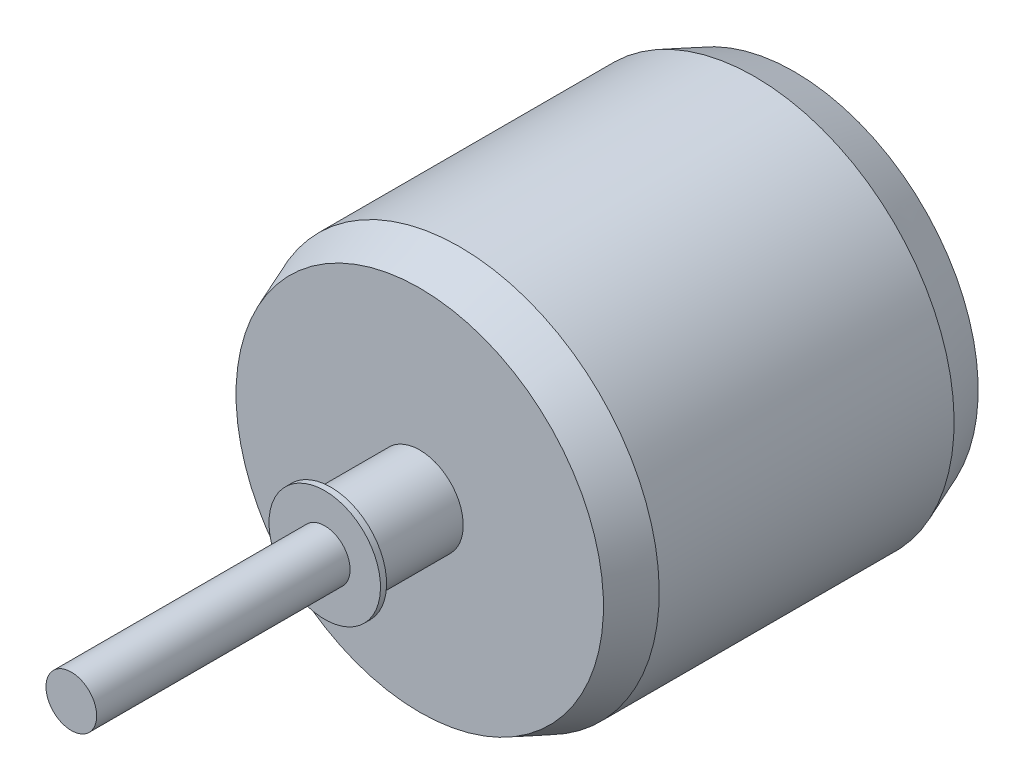
ISO-10303-21;
HEADER;
FILE_DESCRIPTION(('STEP AP214'),'2;1');
FILE_NAME('part.step','',(''),(''),'','','');
FILE_SCHEMA(('AUTOMOTIVE_DESIGN { 1 0 10303 214 1 1 1 1 }'));
ENDSEC;
DATA;
#1=APPLICATION_CONTEXT('core data for automotive mechanical design processes');
#2=APPLICATION_PROTOCOL_DEFINITION('international standard','automotive_design',2000,#1);
#3=PRODUCT_CONTEXT('',#1,'mechanical');
#4=PRODUCT('Part','Part','',(#3));
#5=PRODUCT_RELATED_PRODUCT_CATEGORY('part','',(#4));
#6=PRODUCT_DEFINITION_FORMATION('','',#4);
#7=PRODUCT_DEFINITION_CONTEXT('part definition',#1,'design');
#8=PRODUCT_DEFINITION('design','',#6,#7);
#9=PRODUCT_DEFINITION_SHAPE('','',#8);
#10=(LENGTH_UNIT() NAMED_UNIT(*) SI_UNIT(.MILLI.,.METRE.));
#11=(NAMED_UNIT(*) PLANE_ANGLE_UNIT() SI_UNIT($,.RADIAN.));
#12=(NAMED_UNIT(*) SI_UNIT($,.STERADIAN.) SOLID_ANGLE_UNIT());
#13=UNCERTAINTY_MEASURE_WITH_UNIT(LENGTH_MEASURE(1.E-05),#10,'distance_accuracy_value','');
#14=(GEOMETRIC_REPRESENTATION_CONTEXT(3) GLOBAL_UNCERTAINTY_ASSIGNED_CONTEXT((#13)) GLOBAL_UNIT_ASSIGNED_CONTEXT((#10,
#11,#12)) REPRESENTATION_CONTEXT('',''));
#15=CARTESIAN_POINT('',(0.,0.,0.));
#16=DIRECTION('',(0.,0.,1.));
#17=DIRECTION('',(1.,0.,0.));
#18=AXIS2_PLACEMENT_3D('',#15,#16,#17);
#19=CARTESIAN_POINT('',(0.,0.,-93.1144563688648));
#20=DIRECTION('',(0.,0.,-1.));
#21=DIRECTION('',(0.,1.,0.));
#22=AXIS2_PLACEMENT_3D('',#19,#20,#21);
#23=CYLINDRICAL_SURFACE('',#22,4.);
#24=CARTESIAN_POINT('',(0.,0.,58.65));
#25=DIRECTION('',(0.,0.,-1.));
#26=DIRECTION('',(0.,1.,0.));
#27=AXIS2_PLACEMENT_3D('',#24,#25,#26);
#28=CIRCLE('',#27,4.);
#29=CARTESIAN_POINT('',(0.,3.99999999999999,58.65));
#30=VERTEX_POINT('',#29);
#31=EDGE_CURVE('E10',#30,#30,#28,.T.);
#32=ORIENTED_EDGE('',*,*,#31,.T.);
#33=EDGE_LOOP('',(#32));
#34=FACE_BOUND('',#33,.T.);
#35=CARTESIAN_POINT('',(0.,0.,18.65));
#36=DIRECTION('',(0.,0.,-1.));
#37=DIRECTION('',(0.,1.,0.));
#38=AXIS2_PLACEMENT_3D('',#35,#36,#37);
#39=CIRCLE('',#38,3.99999999999999);
#40=CARTESIAN_POINT('',(0.,3.99999999999999,18.65));
#41=VERTEX_POINT('',#40);
#42=EDGE_CURVE('E94',#41,#41,#39,.T.);
#43=ORIENTED_EDGE('',*,*,#42,.F.);
#44=EDGE_LOOP('',(#43));
#45=FACE_BOUND('',#44,.T.);
#46=ADVANCED_FACE('F43',(#34,#45),#23,.T.);
#47=CARTESIAN_POINT('',(0.,0.,58.65));
#48=DIRECTION('',(0.,0.,1.));
#49=DIRECTION('',(0.,-1.,0.));
#50=AXIS2_PLACEMENT_3D('',#47,#48,#49);
#51=PLANE('',#50);
#52=ORIENTED_EDGE('',*,*,#31,.F.);
#53=EDGE_LOOP('',(#52));
#54=FACE_BOUND('',#53,.T.);
#55=ADVANCED_FACE('F103',(#54),#51,.T.);
#56=CARTESIAN_POINT('',(0.,7.,-58.65));
#57=DIRECTION('',(0.,0.,-1.));
#58=DIRECTION('',(0.,1.,0.));
#59=AXIS2_PLACEMENT_3D('',#56,#57,#58);
#60=PLANE('',#59);
#61=CARTESIAN_POINT('',(0.,0.,-58.65));
#62=DIRECTION('',(0.,0.,-1.));
#63=DIRECTION('',(0.,1.,0.));
#64=AXIS2_PLACEMENT_3D('',#61,#62,#63);
#65=CIRCLE('',#64,6.99999999999999);
#66=CARTESIAN_POINT('',(0.,7.,-58.65));
#67=VERTEX_POINT('',#66);
#68=EDGE_CURVE('E50',#67,#67,#65,.T.);
#69=ORIENTED_EDGE('',*,*,#68,.T.);
#70=EDGE_LOOP('',(#69));
#71=FACE_BOUND('',#70,.T.);
#72=ADVANCED_FACE('F107',(#71),#60,.T.);
#73=CARTESIAN_POINT('',(0.,0.,-93.1144563688648));
#74=DIRECTION('',(0.,0.,-1.));
#75=DIRECTION('',(0.,1.,0.));
#76=AXIS2_PLACEMENT_3D('',#73,#74,#75);
#77=CYLINDRICAL_SURFACE('',#76,6.99999999999999);
#78=CARTESIAN_POINT('',(0.,0.,-55.5));
#79=DIRECTION('',(0.,0.,-1.));
#80=DIRECTION('',(0.,1.,0.));
#81=AXIS2_PLACEMENT_3D('',#78,#79,#80);
#82=CIRCLE('',#81,6.99999999999999);
#83=CARTESIAN_POINT('',(0.,7.,-55.5));
#84=VERTEX_POINT('',#83);
#85=EDGE_CURVE('E55',#84,#84,#82,.T.);
#86=ORIENTED_EDGE('',*,*,#85,.T.);
#87=EDGE_LOOP('',(#86));
#88=FACE_BOUND('',#87,.T.);
#89=ORIENTED_EDGE('',*,*,#68,.F.);
#90=EDGE_LOOP('',(#89));
#91=FACE_BOUND('',#90,.T.);
#92=ADVANCED_FACE('F112',(#88,#91),#77,.T.);
#93=CARTESIAN_POINT('',(0.,7.,-55.5));
#94=DIRECTION('',(0.,0.,-1.));
#95=DIRECTION('',(0.,1.,0.));
#96=AXIS2_PLACEMENT_3D('',#93,#94,#95);
#97=PLANE('',#96);
#98=CARTESIAN_POINT('',(0.,0.,-55.5));
#99=DIRECTION('',(0.,0.,-1.));
#100=DIRECTION('',(0.,1.,0.));
#101=AXIS2_PLACEMENT_3D('',#98,#99,#100);
#102=CIRCLE('',#101,29.);
#103=CARTESIAN_POINT('',(0.,29.,-55.5));
#104=VERTEX_POINT('',#103);
#105=EDGE_CURVE('E60',#104,#104,#102,.T.);
#106=ORIENTED_EDGE('',*,*,#105,.T.);
#107=EDGE_LOOP('',(#106));
#108=FACE_BOUND('',#107,.T.);
#109=ORIENTED_EDGE('',*,*,#85,.F.);
#110=EDGE_LOOP('',(#109));
#111=FACE_BOUND('',#110,.T.);
#112=ADVANCED_FACE('F117',(#108,#111),#97,.T.);
#113=CARTESIAN_POINT('',(0.,0.,-55.5));
#114=DIRECTION('',(0.,0.,1.));
#115=DIRECTION('',(0.,-1.,0.));
#116=AXIS2_PLACEMENT_3D('',#113,#114,#115);
#117=CONICAL_SURFACE('',#116,29.,0.377766657939821);
#118=CARTESIAN_POINT('',(0.,0.,-49.2));
#119=DIRECTION('',(0.,0.,-1.));
#120=DIRECTION('',(0.,1.,0.));
#121=AXIS2_PLACEMENT_3D('',#118,#119,#120);
#122=CIRCLE('',#121,31.5);
#123=CARTESIAN_POINT('',(0.,31.5,-49.2));
#124=VERTEX_POINT('',#123);
#125=EDGE_CURVE('E66',#124,#124,#122,.T.);
#126=ORIENTED_EDGE('',*,*,#125,.T.);
#127=EDGE_LOOP('',(#126));
#128=FACE_BOUND('',#127,.T.);
#129=ORIENTED_EDGE('',*,*,#105,.F.);
#130=EDGE_LOOP('',(#129));
#131=FACE_BOUND('',#130,.T.);
#132=ADVANCED_FACE('F121',(#128,#131),#117,.T.);
#133=CARTESIAN_POINT('',(0.,0.,-93.1144563688648));
#134=DIRECTION('',(0.,0.,-1.));
#135=DIRECTION('',(0.,1.,0.));
#136=AXIS2_PLACEMENT_3D('',#133,#134,#135);
#137=CYLINDRICAL_SURFACE('',#136,31.5);
#138=CARTESIAN_POINT('',(0.,0.,-2.6500461628766));
#139=DIRECTION('',(0.,0.,-1.));
#140=DIRECTION('',(0.,1.,0.));
#141=AXIS2_PLACEMENT_3D('',#138,#139,#140);
#142=CIRCLE('',#141,31.5);
#143=CARTESIAN_POINT('',(0.,31.5,-2.6500461628766));
#144=VERTEX_POINT('',#143);
#145=EDGE_CURVE('E70',#144,#144,#142,.T.);
#146=ORIENTED_EDGE('',*,*,#145,.T.);
#147=EDGE_LOOP('',(#146));
#148=FACE_BOUND('',#147,.T.);
#149=ORIENTED_EDGE('',*,*,#125,.F.);
#150=EDGE_LOOP('',(#149));
#151=FACE_BOUND('',#150,.T.);
#152=ADVANCED_FACE('F125',(#148,#151),#137,.T.);
#153=CARTESIAN_POINT('',(0.,0.,-2.6500461628766));
#154=DIRECTION('',(0.,0.,-1.));
#155=DIRECTION('',(0.,1.,0.));
#156=AXIS2_PLACEMENT_3D('',#153,#154,#155);
#157=CONICAL_SURFACE('',#156,31.5,0.377764145827045);
#158=CARTESIAN_POINT('',(0.,0.,3.65));
#159=DIRECTION('',(0.,0.,-1.));
#160=DIRECTION('',(0.,1.,0.));
#161=AXIS2_PLACEMENT_3D('',#158,#159,#160);
#162=CIRCLE('',#161,29.);
#163=CARTESIAN_POINT('',(0.,29.,3.65000000000001));
#164=VERTEX_POINT('',#163);
#165=EDGE_CURVE('E74',#164,#164,#162,.T.);
#166=ORIENTED_EDGE('',*,*,#165,.T.);
#167=EDGE_LOOP('',(#166));
#168=FACE_BOUND('',#167,.T.);
#169=ORIENTED_EDGE('',*,*,#145,.F.);
#170=EDGE_LOOP('',(#169));
#171=FACE_BOUND('',#170,.T.);
#172=ADVANCED_FACE('F129',(#168,#171),#157,.T.);
#173=CARTESIAN_POINT('',(0.,6.86046624244238,3.65));
#174=DIRECTION('',(0.,0.,1.));
#175=DIRECTION('',(0.,-1.,0.));
#176=AXIS2_PLACEMENT_3D('',#173,#174,#175);
#177=PLANE('',#176);
#178=CARTESIAN_POINT('',(0.,0.,3.65));
#179=DIRECTION('',(0.,0.,-1.));
#180=DIRECTION('',(0.,1.,0.));
#181=AXIS2_PLACEMENT_3D('',#178,#179,#180);
#182=CIRCLE('',#181,6.86046624244238);
#183=CARTESIAN_POINT('',(0.,6.86046624244238,3.65));
#184=VERTEX_POINT('',#183);
#185=EDGE_CURVE('E78',#184,#184,#182,.T.);
#186=ORIENTED_EDGE('',*,*,#185,.T.);
#187=EDGE_LOOP('',(#186));
#188=FACE_BOUND('',#187,.T.);
#189=ORIENTED_EDGE('',*,*,#165,.F.);
#190=EDGE_LOOP('',(#189));
#191=FACE_BOUND('',#190,.T.);
#192=ADVANCED_FACE('F133',(#188,#191),#177,.T.);
#193=CARTESIAN_POINT('',(0.,0.,-93.1144563688648));
#194=DIRECTION('',(0.,0.,-1.));
#195=DIRECTION('',(0.,1.,0.));
#196=AXIS2_PLACEMENT_3D('',#193,#194,#195);
#197=CYLINDRICAL_SURFACE('',#196,6.86046624244238);
#198=CARTESIAN_POINT('',(0.,0.,16.7450871618229));
#199=DIRECTION('',(0.,0.,-1.));
#200=DIRECTION('',(0.,1.,0.));
#201=AXIS2_PLACEMENT_3D('',#198,#199,#200);
#202=CIRCLE('',#201,6.86046624244238);
#203=CARTESIAN_POINT('',(0.,6.86046624244238,16.7450871618229));
#204=VERTEX_POINT('',#203);
#205=EDGE_CURVE('E82',#204,#204,#202,.T.);
#206=ORIENTED_EDGE('',*,*,#205,.T.);
#207=EDGE_LOOP('',(#206));
#208=FACE_BOUND('',#207,.T.);
#209=ORIENTED_EDGE('',*,*,#185,.F.);
#210=EDGE_LOOP('',(#209));
#211=FACE_BOUND('',#210,.T.);
#212=ADVANCED_FACE('F137',(#208,#211),#197,.T.);
#213=CARTESIAN_POINT('',(0.,0.,16.7450871618229));
#214=DIRECTION('',(0.,0.,1.));
#215=DIRECTION('',(0.,-1.,0.));
#216=AXIS2_PLACEMENT_3D('',#213,#214,#215);
#217=CONICAL_SURFACE('',#216,6.86046624244239,1.11969889890767);
#218=CARTESIAN_POINT('',(0.,0.,17.6846153287204));
#219=DIRECTION('',(0.,0.,-1.));
#220=DIRECTION('',(0.,1.,0.));
#221=AXIS2_PLACEMENT_3D('',#218,#219,#220);
#222=CIRCLE('',#221,8.8);
#223=CARTESIAN_POINT('',(0.,8.79999999999999,17.6846153287204));
#224=VERTEX_POINT('',#223);
#225=EDGE_CURVE('E86',#224,#224,#222,.T.);
#226=ORIENTED_EDGE('',*,*,#225,.T.);
#227=EDGE_LOOP('',(#226));
#228=FACE_BOUND('',#227,.T.);
#229=ORIENTED_EDGE('',*,*,#205,.F.);
#230=EDGE_LOOP('',(#229));
#231=FACE_BOUND('',#230,.T.);
#232=ADVANCED_FACE('F141',(#228,#231),#217,.T.);
#233=CARTESIAN_POINT('',(0.,0.,-93.1144563688648));
#234=DIRECTION('',(0.,0.,-1.));
#235=DIRECTION('',(0.,1.,0.));
#236=AXIS2_PLACEMENT_3D('',#233,#234,#235);
#237=CYLINDRICAL_SURFACE('',#236,8.8);
#238=CARTESIAN_POINT('',(0.,0.,18.65));
#239=DIRECTION('',(0.,0.,-1.));
#240=DIRECTION('',(0.,1.,0.));
#241=AXIS2_PLACEMENT_3D('',#238,#239,#240);
#242=CIRCLE('',#241,8.8);
#243=CARTESIAN_POINT('',(0.,8.79999999999999,18.65));
#244=VERTEX_POINT('',#243);
#245=EDGE_CURVE('E90',#244,#244,#242,.T.);
#246=ORIENTED_EDGE('',*,*,#245,.T.);
#247=EDGE_LOOP('',(#246));
#248=FACE_BOUND('',#247,.T.);
#249=ORIENTED_EDGE('',*,*,#225,.F.);
#250=EDGE_LOOP('',(#249));
#251=FACE_BOUND('',#250,.T.);
#252=ADVANCED_FACE('F145',(#248,#251),#237,.T.);
#253=CARTESIAN_POINT('',(0.,3.99999999999999,18.65));
#254=DIRECTION('',(0.,0.,1.));
#255=DIRECTION('',(0.,-1.,0.));
#256=AXIS2_PLACEMENT_3D('',#253,#254,#255);
#257=PLANE('',#256);
#258=ORIENTED_EDGE('',*,*,#42,.T.);
#259=EDGE_LOOP('',(#258));
#260=FACE_BOUND('',#259,.T.);
#261=ORIENTED_EDGE('',*,*,#245,.F.);
#262=EDGE_LOOP('',(#261));
#263=FACE_BOUND('',#262,.T.);
#264=ADVANCED_FACE('F99',(#260,#263),#257,.T.);
#265=CLOSED_SHELL('',(#46,#55,#72,#92,#112,#132,#152,#172,#192,#212,#232,#252,#264));
#266=MANIFOLD_SOLID_BREP('B2',#265);
#267=ADVANCED_BREP_SHAPE_REPRESENTATION('',(#18,#266),#14);
#268=SHAPE_DEFINITION_REPRESENTATION(#9,#267);
ENDSEC;
END-ISO-10303-21;
